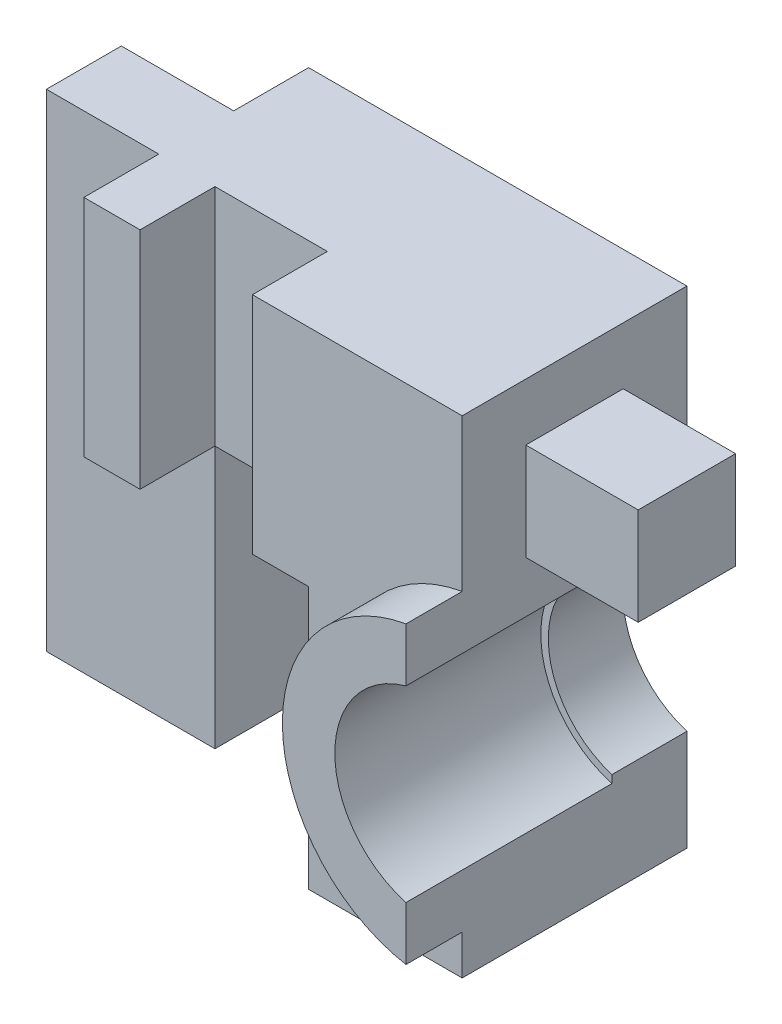
ISO-10303-21;
HEADER;
FILE_DESCRIPTION(('STEP AP214'),'2;1');
FILE_NAME('part.step','',(''),(''),'','','');
FILE_SCHEMA(('AUTOMOTIVE_DESIGN { 1 0 10303 214 1 1 1 1 }'));
ENDSEC;
DATA;
#1=APPLICATION_CONTEXT('core data for automotive mechanical design processes');
#2=APPLICATION_PROTOCOL_DEFINITION('international standard','automotive_design',2000,#1);
#3=PRODUCT_CONTEXT('',#1,'mechanical');
#4=PRODUCT('Part','Part','',(#3));
#5=PRODUCT_RELATED_PRODUCT_CATEGORY('part','',(#4));
#6=PRODUCT_DEFINITION_FORMATION('','',#4);
#7=PRODUCT_DEFINITION_CONTEXT('part definition',#1,'design');
#8=PRODUCT_DEFINITION('design','',#6,#7);
#9=PRODUCT_DEFINITION_SHAPE('','',#8);
#10=(LENGTH_UNIT() NAMED_UNIT(*) SI_UNIT(.MILLI.,.METRE.));
#11=(NAMED_UNIT(*) PLANE_ANGLE_UNIT() SI_UNIT($,.RADIAN.));
#12=(NAMED_UNIT(*) SI_UNIT($,.STERADIAN.) SOLID_ANGLE_UNIT());
#13=UNCERTAINTY_MEASURE_WITH_UNIT(LENGTH_MEASURE(1.E-05),#10,'distance_accuracy_value','');
#14=(GEOMETRIC_REPRESENTATION_CONTEXT(3) GLOBAL_UNCERTAINTY_ASSIGNED_CONTEXT((#13)) GLOBAL_UNIT_ASSIGNED_CONTEXT((#10,
#11,#12)) REPRESENTATION_CONTEXT('',''));
#15=CARTESIAN_POINT('',(0.,0.,0.));
#16=DIRECTION('',(0.,0.,1.));
#17=DIRECTION('',(1.,0.,0.));
#18=AXIS2_PLACEMENT_3D('',#15,#16,#17);
#19=CARTESIAN_POINT('',(-9.2,-5.,4.3));
#20=DIRECTION('',(0.,0.,-1.));
#21=DIRECTION('',(-1.,0.,0.));
#22=AXIS2_PLACEMENT_3D('',#19,#20,#21);
#23=PLANE('',#22);
#24=DIRECTION('',(-1.,0.,0.));
#25=VECTOR('',#24,1.);
#26=CARTESIAN_POINT('',(-9.2,3.87366945943055,4.3));
#27=LINE('',#26,#25);
#28=CARTESIAN_POINT('',(-9.2,3.87366945943055,4.3));
#29=VERTEX_POINT('',#28);
#30=CARTESIAN_POINT('',(-12.2,3.87366945943055,4.3));
#31=VERTEX_POINT('',#30);
#32=EDGE_CURVE('E61',#29,#31,#27,.T.);
#33=ORIENTED_EDGE('',*,*,#32,.F.);
#34=DIRECTION('',(0.,-1.,0.));
#35=VECTOR('',#34,1.);
#36=CARTESIAN_POINT('',(-9.2,6.47366945943055,4.3));
#37=LINE('',#36,#35);
#38=CARTESIAN_POINT('',(-9.2,6.47366945943055,4.3));
#39=VERTEX_POINT('',#38);
#40=EDGE_CURVE('E227',#39,#29,#37,.T.);
#41=ORIENTED_EDGE('',*,*,#40,.F.);
#42=DIRECTION('',(-1.,0.,0.));
#43=VECTOR('',#42,1.);
#44=CARTESIAN_POINT('',(-9.2,6.47366945943055,4.3));
#45=LINE('',#44,#43);
#46=CARTESIAN_POINT('',(-12.2,6.47366945943055,4.3));
#47=VERTEX_POINT('',#46);
#48=EDGE_CURVE('E264',#39,#47,#45,.T.);
#49=ORIENTED_EDGE('',*,*,#48,.T.);
#50=DIRECTION('',(0.,-1.,0.));
#51=VECTOR('',#50,1.);
#52=CARTESIAN_POINT('',(-12.2,-5.,4.3));
#53=LINE('',#52,#51);
#54=EDGE_CURVE('E229',#47,#31,#53,.T.);
#55=ORIENTED_EDGE('',*,*,#54,.T.);
#56=EDGE_LOOP('',(#33,#41,#49,#55));
#57=FACE_BOUND('',#56,.T.);
#58=ADVANCED_FACE('F43',(#57),#23,.F.);
#59=CARTESIAN_POINT('',(-9.2,3.87366945943055,-9.5));
#60=DIRECTION('',(0.,-1.,0.));
#61=DIRECTION('',(0.,0.,-1.));
#62=AXIS2_PLACEMENT_3D('',#59,#60,#61);
#63=PLANE('',#62);
#64=DIRECTION('',(-1.,0.,0.));
#65=VECTOR('',#64,1.);
#66=CARTESIAN_POINT('',(-9.2,3.87366945943055,1.7));
#67=LINE('',#66,#65);
#68=CARTESIAN_POINT('',(-9.2,3.87366945943055,1.7));
#69=VERTEX_POINT('',#68);
#70=CARTESIAN_POINT('',(-12.2,3.87366945943055,1.7));
#71=VERTEX_POINT('',#70);
#72=EDGE_CURVE('E69',#69,#71,#67,.T.);
#73=ORIENTED_EDGE('',*,*,#72,.F.);
#74=DIRECTION('',(0.,0.,-1.));
#75=VECTOR('',#74,1.);
#76=CARTESIAN_POINT('',(-9.2,3.87366945943055,4.3));
#77=LINE('',#76,#75);
#78=EDGE_CURVE('E234',#29,#69,#77,.T.);
#79=ORIENTED_EDGE('',*,*,#78,.F.);
#80=ORIENTED_EDGE('',*,*,#32,.T.);
#81=DIRECTION('',(0.,0.,1.));
#82=VECTOR('',#81,1.);
#83=CARTESIAN_POINT('',(-12.2,3.87366945943055,-9.5));
#84=LINE('',#83,#82);
#85=EDGE_CURVE('E254',#71,#31,#84,.T.);
#86=ORIENTED_EDGE('',*,*,#85,.F.);
#87=EDGE_LOOP('',(#73,#79,#80,#86));
#88=FACE_BOUND('',#87,.T.);
#89=ADVANCED_FACE('F235',(#88),#63,.T.);
#90=CARTESIAN_POINT('',(-9.2,-5.,1.7));
#91=DIRECTION('',(0.,0.,-1.));
#92=DIRECTION('',(-1.,0.,0.));
#93=AXIS2_PLACEMENT_3D('',#90,#91,#92);
#94=PLANE('',#93);
#95=DIRECTION('',(-1.,0.,0.));
#96=VECTOR('',#95,1.);
#97=CARTESIAN_POINT('',(-9.2,6.47366945943055,1.7));
#98=LINE('',#97,#96);
#99=CARTESIAN_POINT('',(-9.2,6.47366945943055,1.7));
#100=VERTEX_POINT('',#99);
#101=CARTESIAN_POINT('',(-12.2,6.47366945943055,1.7));
#102=VERTEX_POINT('',#101);
#103=EDGE_CURVE('E267',#100,#102,#98,.T.);
#104=ORIENTED_EDGE('',*,*,#103,.F.);
#105=DIRECTION('',(0.,1.,0.));
#106=VECTOR('',#105,1.);
#107=CARTESIAN_POINT('',(-9.2,6.47366945943055,1.7));
#108=LINE('',#107,#106);
#109=EDGE_CURVE('E239',#69,#100,#108,.T.);
#110=ORIENTED_EDGE('',*,*,#109,.F.);
#111=ORIENTED_EDGE('',*,*,#72,.T.);
#112=DIRECTION('',(0.,-1.,0.));
#113=VECTOR('',#112,1.);
#114=CARTESIAN_POINT('',(-12.2,-5.,1.7));
#115=LINE('',#114,#113);
#116=EDGE_CURVE('E257',#102,#71,#115,.T.);
#117=ORIENTED_EDGE('',*,*,#116,.F.);
#118=EDGE_LOOP('',(#104,#110,#111,#117));
#119=FACE_BOUND('',#118,.T.);
#120=ADVANCED_FACE('F622',(#119),#94,.T.);
#121=CARTESIAN_POINT('',(-9.2,6.47366945943055,-9.5));
#122=DIRECTION('',(0.,-1.,0.));
#123=DIRECTION('',(0.,0.,-1.));
#124=AXIS2_PLACEMENT_3D('',#121,#122,#123);
#125=PLANE('',#124);
#126=ORIENTED_EDGE('',*,*,#48,.F.);
#127=DIRECTION('',(0.,0.,1.));
#128=VECTOR('',#127,1.);
#129=CARTESIAN_POINT('',(-9.2,6.47366945943055,4.3));
#130=LINE('',#129,#128);
#131=EDGE_CURVE('E244',#100,#39,#130,.T.);
#132=ORIENTED_EDGE('',*,*,#131,.F.);
#133=ORIENTED_EDGE('',*,*,#103,.T.);
#134=DIRECTION('',(0.,0.,1.));
#135=VECTOR('',#134,1.);
#136=CARTESIAN_POINT('',(-12.2,6.47366945943055,-9.5));
#137=LINE('',#136,#135);
#138=EDGE_CURVE('E260',#102,#47,#137,.T.);
#139=ORIENTED_EDGE('',*,*,#138,.T.);
#140=EDGE_LOOP('',(#126,#132,#133,#139));
#141=FACE_BOUND('',#140,.T.);
#142=ADVANCED_FACE('F784',(#141),#125,.F.);
#143=CARTESIAN_POINT('',(-12.2,-5.,-9.5));
#144=DIRECTION('',(-1.,0.,0.));
#145=DIRECTION('',(0.,0.,1.));
#146=AXIS2_PLACEMENT_3D('',#143,#144,#145);
#147=PLANE('',#146);
#148=DIRECTION('',(0.,-1.,0.));
#149=VECTOR('',#148,1.);
#150=CARTESIAN_POINT('',(-12.2,0.,6.));
#151=LINE('',#150,#149);
#152=CARTESIAN_POINT('',(-12.2,8.,6.));
#153=VERTEX_POINT('',#152);
#154=CARTESIAN_POINT('',(-12.2,3.93827373350304,6.));
#155=VERTEX_POINT('',#154);
#156=EDGE_CURVE('E450',#153,#155,#151,.T.);
#157=ORIENTED_EDGE('',*,*,#156,.T.);
#158=DIRECTION('',(0.,0.,-1.));
#159=VECTOR('',#158,1.);
#160=CARTESIAN_POINT('',(-12.2,3.93827373350304,7.5));
#161=LINE('',#160,#159);
#162=CARTESIAN_POINT('',(-12.2,3.93827373350304,7.5));
#163=VERTEX_POINT('',#162);
#164=EDGE_CURVE('E440',#163,#155,#161,.T.);
#165=ORIENTED_EDGE('',*,*,#164,.F.);
#166=DIRECTION('',(0.,-1.,0.));
#167=VECTOR('',#166,1.);
#168=CARTESIAN_POINT('',(-12.2,0.,7.5));
#169=LINE('',#168,#167);
#170=CARTESIAN_POINT('',(-12.2,2.50399680510978,7.5));
#171=VERTEX_POINT('',#170);
#172=EDGE_CURVE('E446',#163,#171,#169,.T.);
#173=ORIENTED_EDGE('',*,*,#172,.T.);
#174=DIRECTION('',(0.,0.,-1.));
#175=VECTOR('',#174,1.);
#176=CARTESIAN_POINT('',(-12.2,2.50399680510978,6.));
#177=LINE('',#176,#175);
#178=CARTESIAN_POINT('',(-12.2,2.50399680510978,2.));
#179=VERTEX_POINT('',#178);
#180=EDGE_CURVE('E53',#171,#179,#177,.T.);
#181=ORIENTED_EDGE('',*,*,#180,.T.);
#182=DIRECTION('',(0.,1.,0.));
#183=VECTOR('',#182,1.);
#184=CARTESIAN_POINT('',(-12.2,0.,2.));
#185=LINE('',#184,#183);
#186=CARTESIAN_POINT('',(-12.2,2.2956480566498,2.));
#187=VERTEX_POINT('',#186);
#188=EDGE_CURVE('E468',#187,#179,#185,.T.);
#189=ORIENTED_EDGE('',*,*,#188,.F.);
#190=DIRECTION('',(0.,0.,-1.));
#191=VECTOR('',#190,1.);
#192=CARTESIAN_POINT('',(-12.2,2.2956480566498,2.));
#193=LINE('',#192,#191);
#194=CARTESIAN_POINT('',(-12.2,2.2956480566498,0.));
#195=VERTEX_POINT('',#194);
#196=EDGE_CURVE('E272',#195,#187,#193,.F.);
#197=ORIENTED_EDGE('',*,*,#196,.F.);
#198=DIRECTION('',(0.,-1.,0.));
#199=VECTOR('',#198,1.);
#200=CARTESIAN_POINT('',(-12.2,0.,0.));
#201=LINE('',#200,#199);
#202=CARTESIAN_POINT('',(-12.2,8.,0.));
#203=VERTEX_POINT('',#202);
#204=EDGE_CURVE('E464',#203,#195,#201,.T.);
#205=ORIENTED_EDGE('',*,*,#204,.F.);
#206=DIRECTION('',(0.,0.,1.));
#207=VECTOR('',#206,1.);
#208=CARTESIAN_POINT('',(-12.2,8.,-9.5));
#209=LINE('',#208,#207);
#210=EDGE_CURVE('E11',#203,#153,#209,.T.);
#211=ORIENTED_EDGE('',*,*,#210,.T.);
#212=EDGE_LOOP('',(#157,#165,#173,#181,#189,#197,#205,#211));
#213=FACE_BOUND('',#212,.T.);
#214=ORIENTED_EDGE('',*,*,#54,.F.);
#215=ORIENTED_EDGE('',*,*,#138,.F.);
#216=ORIENTED_EDGE('',*,*,#116,.T.);
#217=ORIENTED_EDGE('',*,*,#85,.T.);
#218=EDGE_LOOP('',(#214,#215,#216,#217));
#219=FACE_BOUND('',#218,.T.);
#220=ADVANCED_FACE('F543',(#213,#219),#147,.F.);
#221=CARTESIAN_POINT('',(0.,0.,6.));
#222=DIRECTION('',(0.,0.,1.));
#223=DIRECTION('',(1.,0.,0.));
#224=AXIS2_PLACEMENT_3D('',#221,#222,#223);
#225=PLANE('',#224);
#226=DIRECTION('',(0.,-1.,0.));
#227=VECTOR('',#226,1.);
#228=CARTESIAN_POINT('',(-20.8,9.,6.));
#229=LINE('',#228,#227);
#230=CARTESIAN_POINT('',(-20.8,8.,6.));
#231=VERTEX_POINT('',#230);
#232=CARTESIAN_POINT('',(-20.8,2.,6.));
#233=VERTEX_POINT('',#232);
#234=EDGE_CURVE('E409',#231,#233,#229,.T.);
#235=ORIENTED_EDGE('',*,*,#234,.F.);
#236=DIRECTION('',(1.,0.,0.));
#237=VECTOR('',#236,1.);
#238=CARTESIAN_POINT('',(0.,8.,6.));
#239=LINE('',#238,#237);
#240=CARTESIAN_POINT('',(-22.3,8.,6.));
#241=VERTEX_POINT('',#240);
#242=EDGE_CURVE('E286',#241,#231,#239,.T.);
#243=ORIENTED_EDGE('',*,*,#242,.F.);
#244=DIRECTION('',(0.,-1.,0.));
#245=VECTOR('',#244,1.);
#246=CARTESIAN_POINT('',(-22.3,8.,6.));
#247=LINE('',#246,#245);
#248=CARTESIAN_POINT('',(-22.3,2.00000000000001,6.));
#249=VERTEX_POINT('',#248);
#250=EDGE_CURVE('E231',#241,#249,#247,.T.);
#251=ORIENTED_EDGE('',*,*,#250,.T.);
#252=DIRECTION('',(-1.,0.,0.));
#253=VECTOR('',#252,1.);
#254=CARTESIAN_POINT('',(-22.3,2.00000000000001,6.));
#255=LINE('',#254,#253);
#256=EDGE_CURVE('E381',#233,#249,#255,.T.);
#257=ORIENTED_EDGE('',*,*,#256,.F.);
#258=EDGE_LOOP('',(#235,#243,#251,#257));
#259=FACE_BOUND('',#258,.T.);
#260=ADVANCED_FACE('F570',(#259),#225,.T.);
#261=CARTESIAN_POINT('',(0.,2.,0.));
#262=DIRECTION('',(0.,1.,0.));
#263=DIRECTION('',(-1.,0.,0.));
#264=AXIS2_PLACEMENT_3D('',#261,#262,#263);
#265=PLANE('',#264);
#266=DIRECTION('',(1.,0.,0.));
#267=VECTOR('',#266,1.);
#268=CARTESIAN_POINT('',(-20.8,2.00000000000001,4.));
#269=LINE('',#268,#267);
#270=CARTESIAN_POINT('',(-22.3,2.00000000000001,4.));
#271=VERTEX_POINT('',#270);
#272=CARTESIAN_POINT('',(-20.8,2.00000000000001,4.));
#273=VERTEX_POINT('',#272);
#274=EDGE_CURVE('E302',#271,#273,#269,.T.);
#275=ORIENTED_EDGE('',*,*,#274,.T.);
#276=DIRECTION('',(0.,0.,-1.));
#277=VECTOR('',#276,1.);
#278=CARTESIAN_POINT('',(-20.8,2.,4.));
#279=LINE('',#278,#277);
#280=EDGE_CURVE('E414',#233,#273,#279,.T.);
#281=ORIENTED_EDGE('',*,*,#280,.F.);
#282=ORIENTED_EDGE('',*,*,#256,.T.);
#283=DIRECTION('',(0.,0.,-1.));
#284=VECTOR('',#283,1.);
#285=CARTESIAN_POINT('',(-22.3,2.00000000000001,4.));
#286=LINE('',#285,#284);
#287=EDGE_CURVE('E380',#249,#271,#286,.T.);
#288=ORIENTED_EDGE('',*,*,#287,.T.);
#289=EDGE_LOOP('',(#275,#281,#282,#288));
#290=FACE_BOUND('',#289,.T.);
#291=ADVANCED_FACE('F562',(#290),#265,.F.);
#292=CARTESIAN_POINT('',(-16.3,2.,6.));
#293=VERTEX_POINT('',#292);
#294=CARTESIAN_POINT('',(-17.8,2.,6.));
#295=VERTEX_POINT('',#294);
#296=EDGE_CURVE('E375',#293,#295,#255,.T.);
#297=ORIENTED_EDGE('',*,*,#296,.T.);
#298=DIRECTION('',(0.,0.,1.));
#299=VECTOR('',#298,1.);
#300=CARTESIAN_POINT('',(-17.8,2.,4.));
#301=LINE('',#300,#299);
#302=CARTESIAN_POINT('',(-17.8,2.,4.));
#303=VERTEX_POINT('',#302);
#304=EDGE_CURVE('E419',#303,#295,#301,.T.);
#305=ORIENTED_EDGE('',*,*,#304,.F.);
#306=DIRECTION('',(1.,0.,0.));
#307=VECTOR('',#306,1.);
#308=CARTESIAN_POINT('',(-16.3,2.,4.));
#309=LINE('',#308,#307);
#310=CARTESIAN_POINT('',(-16.3,2.,4.));
#311=VERTEX_POINT('',#310);
#312=EDGE_CURVE('E379',#303,#311,#309,.T.);
#313=ORIENTED_EDGE('',*,*,#312,.T.);
#314=DIRECTION('',(0.,0.,1.));
#315=VECTOR('',#314,1.);
#316=CARTESIAN_POINT('',(-16.3,2.,6.));
#317=LINE('',#316,#315);
#318=EDGE_CURVE('E382',#311,#293,#317,.T.);
#319=ORIENTED_EDGE('',*,*,#318,.T.);
#320=EDGE_LOOP('',(#297,#305,#313,#319));
#321=FACE_BOUND('',#320,.T.);
#322=ADVANCED_FACE('F598',(#321),#265,.F.);
#323=CARTESIAN_POINT('',(0.,-5.,6.));
#324=DIRECTION('',(0.,1.,0.));
#325=DIRECTION('',(-1.,0.,0.));
#326=AXIS2_PLACEMENT_3D('',#323,#324,#325);
#327=PLANE('',#326);
#328=DIRECTION('',(1.,0.,0.));
#329=VECTOR('',#328,1.);
#330=CARTESIAN_POINT('',(0.,-5.,0.));
#331=LINE('',#330,#329);
#332=CARTESIAN_POINT('',(-17.8,-4.99999999999999,0.));
#333=VERTEX_POINT('',#332);
#334=CARTESIAN_POINT('',(-12.2,-5.,0.));
#335=VERTEX_POINT('',#334);
#336=EDGE_CURVE('E386',#333,#335,#331,.T.);
#337=ORIENTED_EDGE('',*,*,#336,.T.);
#338=DIRECTION('',(0.,0.,1.));
#339=VECTOR('',#338,1.);
#340=CARTESIAN_POINT('',(-12.2,-5.,-9.5));
#341=LINE('',#340,#339);
#342=CARTESIAN_POINT('',(-12.2,-5.,6.));
#343=VERTEX_POINT('',#342);
#344=EDGE_CURVE('E470',#335,#343,#341,.T.);
#345=ORIENTED_EDGE('',*,*,#344,.T.);
#346=DIRECTION('',(1.,0.,0.));
#347=VECTOR('',#346,1.);
#348=CARTESIAN_POINT('',(0.,-5.,6.));
#349=LINE('',#348,#347);
#350=CARTESIAN_POINT('',(-16.3,-5.,6.));
#351=VERTEX_POINT('',#350);
#352=EDGE_CURVE('E287',#351,#343,#349,.T.);
#353=ORIENTED_EDGE('',*,*,#352,.F.);
#354=DIRECTION('',(0.,0.,1.));
#355=VECTOR('',#354,1.);
#356=CARTESIAN_POINT('',(-16.3,-5.,6.));
#357=LINE('',#356,#355);
#358=CARTESIAN_POINT('',(-16.3,-5.,4.));
#359=VERTEX_POINT('',#358);
#360=EDGE_CURVE('E281',#359,#351,#357,.T.);
#361=ORIENTED_EDGE('',*,*,#360,.F.);
#362=DIRECTION('',(1.,0.,0.));
#363=VECTOR('',#362,1.);
#364=CARTESIAN_POINT('',(-16.3,-5.,4.));
#365=LINE('',#364,#363);
#366=CARTESIAN_POINT('',(-17.8,-4.99999999999999,4.));
#367=VERTEX_POINT('',#366);
#368=EDGE_CURVE('E356',#367,#359,#365,.T.);
#369=ORIENTED_EDGE('',*,*,#368,.F.);
#370=DIRECTION('',(0.,0.,1.));
#371=VECTOR('',#370,1.);
#372=CARTESIAN_POINT('',(-17.8,-4.99999999999999,4.));
#373=LINE('',#372,#371);
#374=EDGE_CURVE('E352',#333,#367,#373,.T.);
#375=ORIENTED_EDGE('',*,*,#374,.F.);
#376=EDGE_LOOP('',(#337,#345,#353,#361,#369,#375));
#377=FACE_BOUND('',#376,.T.);
#378=ADVANCED_FACE('F522',(#377),#327,.F.);
#379=CARTESIAN_POINT('',(-11.5,0.,6.));
#380=DIRECTION('',(0.,0.,-1.));
#381=DIRECTION('',(-1.,0.,0.));
#382=AXIS2_PLACEMENT_3D('',#379,#380,#381);
#383=CYLINDRICAL_SURFACE('',#382,2.6);
#384=ORIENTED_EDGE('',*,*,#180,.F.);
#385=CARTESIAN_POINT('',(-11.5,0.,7.5));
#386=DIRECTION('',(0.,0.,1.));
#387=DIRECTION('',(1.,0.,0.));
#388=AXIS2_PLACEMENT_3D('',#385,#386,#387);
#389=CIRCLE('',#388,2.6);
#390=CARTESIAN_POINT('',(-12.2,-2.50399680510978,7.5));
#391=VERTEX_POINT('',#390);
#392=EDGE_CURVE('E474',#171,#391,#389,.T.);
#393=ORIENTED_EDGE('',*,*,#392,.T.);
#394=DIRECTION('',(0.,0.,-1.));
#395=VECTOR('',#394,1.);
#396=CARTESIAN_POINT('',(-12.2,-2.50399680510978,6.));
#397=LINE('',#396,#395);
#398=CARTESIAN_POINT('',(-12.2,-2.50399680510978,2.));
#399=VERTEX_POINT('',#398);
#400=EDGE_CURVE('E449',#399,#391,#397,.F.);
#401=ORIENTED_EDGE('',*,*,#400,.F.);
#402=CARTESIAN_POINT('',(-11.5,0.,2.));
#403=DIRECTION('',(0.,0.,-1.));
#404=DIRECTION('',(-1.,0.,0.));
#405=AXIS2_PLACEMENT_3D('',#402,#403,#404);
#406=CIRCLE('',#405,2.6);
#407=EDGE_CURVE('E429',#399,#179,#406,.T.);
#408=ORIENTED_EDGE('',*,*,#407,.T.);
#409=EDGE_LOOP('',(#384,#393,#401,#408));
#410=FACE_BOUND('',#409,.T.);
#411=ADVANCED_FACE('F541',(#410),#383,.F.);
#412=ORIENTED_EDGE('',*,*,#156,.F.);
#413=CARTESIAN_POINT('',(-17.8,8.,6.));
#414=VERTEX_POINT('',#413);
#415=EDGE_CURVE('E478',#414,#153,#239,.T.);
#416=ORIENTED_EDGE('',*,*,#415,.F.);
#417=DIRECTION('',(0.,-1.,0.));
#418=VECTOR('',#417,1.);
#419=CARTESIAN_POINT('',(-17.8,9.,6.));
#420=LINE('',#419,#418);
#421=EDGE_CURVE('E364',#414,#295,#420,.T.);
#422=ORIENTED_EDGE('',*,*,#421,.T.);
#423=ORIENTED_EDGE('',*,*,#296,.F.);
#424=DIRECTION('',(0.,-1.,0.));
#425=VECTOR('',#424,1.);
#426=CARTESIAN_POINT('',(-16.3,2.,6.));
#427=LINE('',#426,#425);
#428=EDGE_CURVE('E360',#293,#351,#427,.T.);
#429=ORIENTED_EDGE('',*,*,#428,.T.);
#430=ORIENTED_EDGE('',*,*,#352,.T.);
#431=CARTESIAN_POINT('',(-12.2,-3.93827373350304,6.));
#432=VERTEX_POINT('',#431);
#433=EDGE_CURVE('E437',#432,#343,#151,.T.);
#434=ORIENTED_EDGE('',*,*,#433,.F.);
#435=CARTESIAN_POINT('',(-11.5,0.,6.));
#436=DIRECTION('',(0.,0.,1.));
#437=DIRECTION('',(1.,0.,0.));
#438=AXIS2_PLACEMENT_3D('',#435,#436,#437);
#439=CIRCLE('',#438,4.);
#440=EDGE_CURVE('E47',#155,#432,#439,.T.);
#441=ORIENTED_EDGE('',*,*,#440,.F.);
#442=EDGE_LOOP('',(#412,#416,#422,#423,#429,#430,#434,#441));
#443=FACE_BOUND('',#442,.T.);
#444=ADVANCED_FACE('F516',(#443),#225,.T.);
#445=CARTESIAN_POINT('',(-22.3,8.,6.));
#446=DIRECTION('',(1.,0.,0.));
#447=DIRECTION('',(0.,0.,-1.));
#448=AXIS2_PLACEMENT_3D('',#445,#446,#447);
#449=PLANE('',#448);
#450=DIRECTION('',(0.,1.,0.));
#451=VECTOR('',#450,1.);
#452=CARTESIAN_POINT('',(-22.3,-8.60555127546399,4.));
#453=LINE('',#452,#451);
#454=CARTESIAN_POINT('',(-22.3,8.,4.));
#455=VERTEX_POINT('',#454);
#456=EDGE_CURVE('E312',#271,#455,#453,.T.);
#457=ORIENTED_EDGE('',*,*,#456,.F.);
#458=ORIENTED_EDGE('',*,*,#287,.F.);
#459=ORIENTED_EDGE('',*,*,#250,.F.);
#460=DIRECTION('',(0.,0.,-1.));
#461=VECTOR('',#460,1.);
#462=CARTESIAN_POINT('',(-22.3,8.,6.));
#463=LINE('',#462,#461);
#464=EDGE_CURVE('E282',#241,#455,#463,.T.);
#465=ORIENTED_EDGE('',*,*,#464,.T.);
#466=EDGE_LOOP('',(#457,#458,#459,#465));
#467=FACE_BOUND('',#466,.T.);
#468=ADVANCED_FACE('F569',(#467),#449,.F.);
#469=CARTESIAN_POINT('',(0.,8.,6.));
#470=DIRECTION('',(0.,1.,0.));
#471=DIRECTION('',(0.,0.,1.));
#472=AXIS2_PLACEMENT_3D('',#469,#470,#471);
#473=PLANE('',#472);
#474=ORIENTED_EDGE('',*,*,#210,.F.);
#475=DIRECTION('',(1.,0.,0.));
#476=VECTOR('',#475,1.);
#477=CARTESIAN_POINT('',(0.,8.,0.));
#478=LINE('',#477,#476);
#479=CARTESIAN_POINT('',(-22.3,8.,0.));
#480=VERTEX_POINT('',#479);
#481=EDGE_CURVE('E292',#480,#203,#478,.T.);
#482=ORIENTED_EDGE('',*,*,#481,.F.);
#483=CARTESIAN_POINT('',(-22.3,8.,2.));
#484=VERTEX_POINT('',#483);
#485=EDGE_CURVE('E288',#484,#480,#463,.T.);
#486=ORIENTED_EDGE('',*,*,#485,.F.);
#487=DIRECTION('',(1.,0.,0.));
#488=VECTOR('',#487,1.);
#489=CARTESIAN_POINT('',(0.,8.,1.99999999999999));
#490=LINE('',#489,#488);
#491=CARTESIAN_POINT('',(-25.3,8.,2.));
#492=VERTEX_POINT('',#491);
#493=EDGE_CURVE('E323',#492,#484,#490,.T.);
#494=ORIENTED_EDGE('',*,*,#493,.F.);
#495=DIRECTION('',(0.,0.,-1.));
#496=VECTOR('',#495,1.);
#497=CARTESIAN_POINT('',(-25.3,8.,6.));
#498=LINE('',#497,#496);
#499=CARTESIAN_POINT('',(-25.3,8.,4.));
#500=VERTEX_POINT('',#499);
#501=EDGE_CURVE('E319',#500,#492,#498,.T.);
#502=ORIENTED_EDGE('',*,*,#501,.F.);
#503=DIRECTION('',(-1.,0.,0.));
#504=VECTOR('',#503,1.);
#505=CARTESIAN_POINT('',(0.,8.,3.99999999999999));
#506=LINE('',#505,#504);
#507=EDGE_CURVE('E315',#455,#500,#506,.T.);
#508=ORIENTED_EDGE('',*,*,#507,.F.);
#509=ORIENTED_EDGE('',*,*,#464,.F.);
#510=ORIENTED_EDGE('',*,*,#242,.T.);
#511=DIRECTION('',(0.,0.,1.));
#512=VECTOR('',#511,1.);
#513=CARTESIAN_POINT('',(-20.8,8.,6.));
#514=LINE('',#513,#512);
#515=CARTESIAN_POINT('',(-20.8,8.,4.));
#516=VERTEX_POINT('',#515);
#517=EDGE_CURVE('E398',#516,#231,#514,.T.);
#518=ORIENTED_EDGE('',*,*,#517,.F.);
#519=DIRECTION('',(-1.,0.,0.));
#520=VECTOR('',#519,1.);
#521=CARTESIAN_POINT('',(0.,8.,4.));
#522=LINE('',#521,#520);
#523=CARTESIAN_POINT('',(-17.8,8.,4.));
#524=VERTEX_POINT('',#523);
#525=EDGE_CURVE('E415',#524,#516,#522,.T.);
#526=ORIENTED_EDGE('',*,*,#525,.F.);
#527=DIRECTION('',(0.,0.,-1.));
#528=VECTOR('',#527,1.);
#529=CARTESIAN_POINT('',(-17.8,8.,6.));
#530=LINE('',#529,#528);
#531=EDGE_CURVE('E410',#414,#524,#530,.T.);
#532=ORIENTED_EDGE('',*,*,#531,.F.);
#533=ORIENTED_EDGE('',*,*,#415,.T.);
#534=EDGE_LOOP('',(#474,#482,#486,#494,#502,#508,#509,#510,#518,#526,#532,#533));
#535=FACE_BOUND('',#534,.T.);
#536=ADVANCED_FACE('F552',(#535),#473,.T.);
#537=CARTESIAN_POINT('',(-22.3,-5.,0.));
#538=VERTEX_POINT('',#537);
#539=CARTESIAN_POINT('',(-20.8,-4.99999999999999,0.));
#540=VERTEX_POINT('',#539);
#541=EDGE_CURVE('E293',#538,#540,#331,.T.);
#542=ORIENTED_EDGE('',*,*,#541,.T.);
#543=DIRECTION('',(0.,0.,-1.));
#544=VECTOR('',#543,1.);
#545=CARTESIAN_POINT('',(-20.8,-4.99999999999999,0.));
#546=LINE('',#545,#544);
#547=CARTESIAN_POINT('',(-20.8,-4.99999999999999,4.));
#548=VERTEX_POINT('',#547);
#549=EDGE_CURVE('E344',#548,#540,#546,.T.);
#550=ORIENTED_EDGE('',*,*,#549,.F.);
#551=DIRECTION('',(1.,0.,0.));
#552=VECTOR('',#551,1.);
#553=CARTESIAN_POINT('',(0.,-5.,3.99999999999999));
#554=LINE('',#553,#552);
#555=CARTESIAN_POINT('',(-25.3,-4.99999999999999,4.));
#556=VERTEX_POINT('',#555);
#557=EDGE_CURVE('E316',#556,#548,#554,.T.);
#558=ORIENTED_EDGE('',*,*,#557,.F.);
#559=DIRECTION('',(0.,0.,1.));
#560=VECTOR('',#559,1.);
#561=CARTESIAN_POINT('',(-25.3,-4.99999999999999,6.));
#562=LINE('',#561,#560);
#563=CARTESIAN_POINT('',(-25.3,-4.99999999999999,2.));
#564=VERTEX_POINT('',#563);
#565=EDGE_CURVE('E298',#564,#556,#562,.T.);
#566=ORIENTED_EDGE('',*,*,#565,.F.);
#567=DIRECTION('',(-1.,0.,0.));
#568=VECTOR('',#567,1.);
#569=CARTESIAN_POINT('',(0.,-5.,1.99999999999999));
#570=LINE('',#569,#568);
#571=CARTESIAN_POINT('',(-22.3,-4.99999999999999,2.));
#572=VERTEX_POINT('',#571);
#573=EDGE_CURVE('E324',#572,#564,#570,.T.);
#574=ORIENTED_EDGE('',*,*,#573,.F.);
#575=DIRECTION('',(0.,0.,-1.));
#576=VECTOR('',#575,1.);
#577=CARTESIAN_POINT('',(-22.3,-5.,6.));
#578=LINE('',#577,#576);
#579=EDGE_CURVE('E289',#572,#538,#578,.T.);
#580=ORIENTED_EDGE('',*,*,#579,.T.);
#581=EDGE_LOOP('',(#542,#550,#558,#566,#574,#580));
#582=FACE_BOUND('',#581,.T.);
#583=ADVANCED_FACE('F45',(#582),#327,.F.);
#584=CARTESIAN_POINT('',(0.,0.,0.));
#585=DIRECTION('',(0.,0.,1.));
#586=DIRECTION('',(1.,0.,0.));
#587=AXIS2_PLACEMENT_3D('',#584,#585,#586);
#588=PLANE('',#587);
#589=ORIENTED_EDGE('',*,*,#481,.T.);
#590=ORIENTED_EDGE('',*,*,#204,.T.);
#591=CARTESIAN_POINT('',(-11.5,0.,0.));
#592=DIRECTION('',(0.,0.,-1.));
#593=DIRECTION('',(-1.,0.,0.));
#594=AXIS2_PLACEMENT_3D('',#591,#592,#593);
#595=CIRCLE('',#594,2.4);
#596=CARTESIAN_POINT('',(-12.2,-2.2956480566498,0.));
#597=VERTEX_POINT('',#596);
#598=EDGE_CURVE('E277',#597,#195,#595,.T.);
#599=ORIENTED_EDGE('',*,*,#598,.F.);
#600=EDGE_CURVE('E348',#597,#335,#201,.T.);
#601=ORIENTED_EDGE('',*,*,#600,.T.);
#602=ORIENTED_EDGE('',*,*,#336,.F.);
#603=DIRECTION('',(0.,-1.,0.));
#604=VECTOR('',#603,1.);
#605=CARTESIAN_POINT('',(-17.8,2.00000000000001,0.));
#606=LINE('',#605,#604);
#607=CARTESIAN_POINT('',(-17.8,2.00000000000001,0.));
#608=VERTEX_POINT('',#607);
#609=EDGE_CURVE('E349',#608,#333,#606,.T.);
#610=ORIENTED_EDGE('',*,*,#609,.F.);
#611=DIRECTION('',(1.,0.,0.));
#612=VECTOR('',#611,1.);
#613=CARTESIAN_POINT('',(-17.8,2.00000000000001,0.));
#614=LINE('',#613,#612);
#615=CARTESIAN_POINT('',(-20.8,2.00000000000001,0.));
#616=VERTEX_POINT('',#615);
#617=EDGE_CURVE('E394',#616,#608,#614,.T.);
#618=ORIENTED_EDGE('',*,*,#617,.F.);
#619=DIRECTION('',(0.,-1.,0.));
#620=VECTOR('',#619,1.);
#621=CARTESIAN_POINT('',(-20.8,2.00000000000001,0.));
#622=LINE('',#621,#620);
#623=EDGE_CURVE('E311',#616,#540,#622,.T.);
#624=ORIENTED_EDGE('',*,*,#623,.T.);
#625=ORIENTED_EDGE('',*,*,#541,.F.);
#626=DIRECTION('',(0.,-1.,0.));
#627=VECTOR('',#626,1.);
#628=CARTESIAN_POINT('',(-22.3,8.,0.));
#629=LINE('',#628,#627);
#630=EDGE_CURVE('E294',#480,#538,#629,.T.);
#631=ORIENTED_EDGE('',*,*,#630,.F.);
#632=EDGE_LOOP('',(#589,#590,#599,#601,#602,#610,#618,#624,#625,#631));
#633=FACE_BOUND('',#632,.T.);
#634=ADVANCED_FACE('F528',(#633),#588,.F.);
#635=ORIENTED_EDGE('',*,*,#579,.F.);
#636=DIRECTION('',(0.,1.,0.));
#637=VECTOR('',#636,1.);
#638=CARTESIAN_POINT('',(-22.3,-8.60555127546399,2.));
#639=LINE('',#638,#637);
#640=EDGE_CURVE('E307',#572,#484,#639,.T.);
#641=ORIENTED_EDGE('',*,*,#640,.T.);
#642=ORIENTED_EDGE('',*,*,#485,.T.);
#643=ORIENTED_EDGE('',*,*,#630,.T.);
#644=EDGE_LOOP('',(#635,#641,#642,#643));
#645=FACE_BOUND('',#644,.T.);
#646=ADVANCED_FACE('F626',(#645),#449,.F.);
#647=CARTESIAN_POINT('',(-25.3,-8.60555127546399,6.));
#648=DIRECTION('',(1.,0.,0.));
#649=DIRECTION('',(0.,0.,-1.));
#650=AXIS2_PLACEMENT_3D('',#647,#648,#649);
#651=PLANE('',#650);
#652=DIRECTION('',(0.,1.,0.));
#653=VECTOR('',#652,1.);
#654=CARTESIAN_POINT('',(-25.3,-8.60555127546399,2.));
#655=LINE('',#654,#653);
#656=EDGE_CURVE('E320',#564,#492,#655,.T.);
#657=ORIENTED_EDGE('',*,*,#656,.F.);
#658=ORIENTED_EDGE('',*,*,#565,.T.);
#659=DIRECTION('',(0.,1.,0.));
#660=VECTOR('',#659,1.);
#661=CARTESIAN_POINT('',(-25.3,-8.60555127546399,4.));
#662=LINE('',#661,#660);
#663=EDGE_CURVE('E306',#556,#500,#662,.T.);
#664=ORIENTED_EDGE('',*,*,#663,.T.);
#665=ORIENTED_EDGE('',*,*,#501,.T.);
#666=EDGE_LOOP('',(#657,#658,#664,#665));
#667=FACE_BOUND('',#666,.T.);
#668=ADVANCED_FACE('F629',(#667),#651,.F.);
#669=CARTESIAN_POINT('',(0.,-8.60555127546399,3.99999999999999));
#670=DIRECTION('',(0.,0.,-1.));
#671=DIRECTION('',(-1.,0.,0.));
#672=AXIS2_PLACEMENT_3D('',#669,#670,#671);
#673=PLANE('',#672);
#674=ORIENTED_EDGE('',*,*,#663,.F.);
#675=ORIENTED_EDGE('',*,*,#557,.T.);
#676=DIRECTION('',(0.,-1.,0.));
#677=VECTOR('',#676,1.);
#678=CARTESIAN_POINT('',(-20.8,2.00000000000001,4.));
#679=LINE('',#678,#677);
#680=EDGE_CURVE('E339',#273,#548,#679,.T.);
#681=ORIENTED_EDGE('',*,*,#680,.F.);
#682=ORIENTED_EDGE('',*,*,#274,.F.);
#683=ORIENTED_EDGE('',*,*,#456,.T.);
#684=ORIENTED_EDGE('',*,*,#507,.T.);
#685=EDGE_LOOP('',(#674,#675,#681,#682,#683,#684));
#686=FACE_BOUND('',#685,.T.);
#687=ADVANCED_FACE('F578',(#686),#673,.F.);
#688=CARTESIAN_POINT('',(0.,-8.60555127546399,1.99999999999999));
#689=DIRECTION('',(0.,0.,1.));
#690=DIRECTION('',(1.,0.,0.));
#691=AXIS2_PLACEMENT_3D('',#688,#689,#690);
#692=PLANE('',#691);
#693=ORIENTED_EDGE('',*,*,#640,.F.);
#694=ORIENTED_EDGE('',*,*,#573,.T.);
#695=ORIENTED_EDGE('',*,*,#656,.T.);
#696=ORIENTED_EDGE('',*,*,#493,.T.);
#697=EDGE_LOOP('',(#693,#694,#695,#696));
#698=FACE_BOUND('',#697,.T.);
#699=ADVANCED_FACE('F631',(#698),#692,.F.);
#700=CARTESIAN_POINT('',(-11.5,0.,7.5));
#701=DIRECTION('',(0.,0.,1.));
#702=DIRECTION('',(1.,0.,0.));
#703=AXIS2_PLACEMENT_3D('',#700,#701,#702);
#704=PLANE('',#703);
#705=ORIENTED_EDGE('',*,*,#172,.F.);
#706=CARTESIAN_POINT('',(-11.5,0.,7.5));
#707=DIRECTION('',(0.,0.,1.));
#708=DIRECTION('',(1.,0.,0.));
#709=AXIS2_PLACEMENT_3D('',#706,#707,#708);
#710=CIRCLE('',#709,4.);
#711=CARTESIAN_POINT('',(-12.2,-3.93827373350304,7.5));
#712=VERTEX_POINT('',#711);
#713=EDGE_CURVE('E333',#163,#712,#710,.T.);
#714=ORIENTED_EDGE('',*,*,#713,.T.);
#715=EDGE_CURVE('E456',#391,#712,#169,.T.);
#716=ORIENTED_EDGE('',*,*,#715,.F.);
#717=ORIENTED_EDGE('',*,*,#392,.F.);
#718=EDGE_LOOP('',(#705,#714,#716,#717));
#719=FACE_BOUND('',#718,.T.);
#720=ADVANCED_FACE('F505',(#719),#704,.T.);
#721=CARTESIAN_POINT('',(-11.5,0.,7.5));
#722=DIRECTION('',(0.,0.,-1.));
#723=DIRECTION('',(-1.,0.,0.));
#724=AXIS2_PLACEMENT_3D('',#721,#722,#723);
#725=CYLINDRICAL_SURFACE('',#724,4.);
#726=ORIENTED_EDGE('',*,*,#713,.F.);
#727=ORIENTED_EDGE('',*,*,#164,.T.);
#728=ORIENTED_EDGE('',*,*,#440,.T.);
#729=DIRECTION('',(0.,0.,-1.));
#730=VECTOR('',#729,1.);
#731=CARTESIAN_POINT('',(-12.2,-3.93827373350304,7.5));
#732=LINE('',#731,#730);
#733=EDGE_CURVE('E451',#432,#712,#732,.F.);
#734=ORIENTED_EDGE('',*,*,#733,.T.);
#735=EDGE_LOOP('',(#726,#727,#728,#734));
#736=FACE_BOUND('',#735,.T.);
#737=ADVANCED_FACE('F508',(#736),#725,.T.);
#738=CARTESIAN_POINT('',(-11.5,0.,2.));
#739=DIRECTION('',(0.,0.,-1.));
#740=DIRECTION('',(-1.,0.,0.));
#741=AXIS2_PLACEMENT_3D('',#738,#739,#740);
#742=PLANE('',#741);
#743=ORIENTED_EDGE('',*,*,#407,.F.);
#744=CARTESIAN_POINT('',(-12.2,-2.2956480566498,2.));
#745=VERTEX_POINT('',#744);
#746=EDGE_CURVE('E455',#399,#745,#185,.T.);
#747=ORIENTED_EDGE('',*,*,#746,.T.);
#748=CARTESIAN_POINT('',(-11.5,0.,2.));
#749=DIRECTION('',(0.,0.,-1.));
#750=DIRECTION('',(-1.,0.,0.));
#751=AXIS2_PLACEMENT_3D('',#748,#749,#750);
#752=CIRCLE('',#751,2.4);
#753=EDGE_CURVE('E467',#745,#187,#752,.T.);
#754=ORIENTED_EDGE('',*,*,#753,.T.);
#755=ORIENTED_EDGE('',*,*,#188,.T.);
#756=EDGE_LOOP('',(#743,#747,#754,#755));
#757=FACE_BOUND('',#756,.T.);
#758=ADVANCED_FACE('F537',(#757),#742,.F.);
#759=CARTESIAN_POINT('',(-11.5,0.,2.));
#760=DIRECTION('',(0.,0.,-1.));
#761=DIRECTION('',(-1.,0.,0.));
#762=AXIS2_PLACEMENT_3D('',#759,#760,#761);
#763=CYLINDRICAL_SURFACE('',#762,2.4);
#764=ORIENTED_EDGE('',*,*,#598,.T.);
#765=ORIENTED_EDGE('',*,*,#196,.T.);
#766=ORIENTED_EDGE('',*,*,#753,.F.);
#767=DIRECTION('',(0.,0.,-1.));
#768=VECTOR('',#767,1.);
#769=CARTESIAN_POINT('',(-12.2,-2.2956480566498,2.));
#770=LINE('',#769,#768);
#771=EDGE_CURVE('E276',#745,#597,#770,.T.);
#772=ORIENTED_EDGE('',*,*,#771,.T.);
#773=EDGE_LOOP('',(#764,#765,#766,#772));
#774=FACE_BOUND('',#773,.T.);
#775=ADVANCED_FACE('F532',(#774),#763,.F.);
#776=CARTESIAN_POINT('',(-16.3,2.,6.));
#777=DIRECTION('',(1.,0.,0.));
#778=DIRECTION('',(0.,1.,0.));
#779=AXIS2_PLACEMENT_3D('',#776,#777,#778);
#780=PLANE('',#779);
#781=ORIENTED_EDGE('',*,*,#360,.T.);
#782=ORIENTED_EDGE('',*,*,#428,.F.);
#783=ORIENTED_EDGE('',*,*,#318,.F.);
#784=DIRECTION('',(0.,-1.,0.));
#785=VECTOR('',#784,1.);
#786=CARTESIAN_POINT('',(-16.3,2.,4.));
#787=LINE('',#786,#785);
#788=EDGE_CURVE('E357',#311,#359,#787,.T.);
#789=ORIENTED_EDGE('',*,*,#788,.T.);
#790=EDGE_LOOP('',(#781,#782,#783,#789));
#791=FACE_BOUND('',#790,.T.);
#792=ADVANCED_FACE('F646',(#791),#780,.F.);
#793=CARTESIAN_POINT('',(-16.3,2.,4.));
#794=DIRECTION('',(0.,0.,-1.));
#795=DIRECTION('',(-1.,0.,0.));
#796=AXIS2_PLACEMENT_3D('',#793,#794,#795);
#797=PLANE('',#796);
#798=ORIENTED_EDGE('',*,*,#368,.T.);
#799=ORIENTED_EDGE('',*,*,#788,.F.);
#800=ORIENTED_EDGE('',*,*,#312,.F.);
#801=DIRECTION('',(0.,-1.,0.));
#802=VECTOR('',#801,1.);
#803=CARTESIAN_POINT('',(-17.8,2.00000000000001,4.));
#804=LINE('',#803,#802);
#805=EDGE_CURVE('E353',#303,#367,#804,.T.);
#806=ORIENTED_EDGE('',*,*,#805,.T.);
#807=EDGE_LOOP('',(#798,#799,#800,#806));
#808=FACE_BOUND('',#807,.T.);
#809=ADVANCED_FACE('F593',(#808),#797,.F.);
#810=CARTESIAN_POINT('',(-17.8,2.00000000000001,4.));
#811=DIRECTION('',(1.,0.,0.));
#812=DIRECTION('',(0.,1.,0.));
#813=AXIS2_PLACEMENT_3D('',#810,#811,#812);
#814=PLANE('',#813);
#815=ORIENTED_EDGE('',*,*,#374,.T.);
#816=ORIENTED_EDGE('',*,*,#805,.F.);
#817=DIRECTION('',(0.,0.,1.));
#818=VECTOR('',#817,1.);
#819=CARTESIAN_POINT('',(-17.8,2.00000000000001,4.));
#820=LINE('',#819,#818);
#821=EDGE_CURVE('E343',#608,#303,#820,.T.);
#822=ORIENTED_EDGE('',*,*,#821,.F.);
#823=ORIENTED_EDGE('',*,*,#609,.T.);
#824=EDGE_LOOP('',(#815,#816,#822,#823));
#825=FACE_BOUND('',#824,.T.);
#826=ADVANCED_FACE('F590',(#825),#814,.F.);
#827=CARTESIAN_POINT('',(-20.8,2.00000000000001,0.));
#828=DIRECTION('',(-1.,0.,0.));
#829=DIRECTION('',(0.,-1.,0.));
#830=AXIS2_PLACEMENT_3D('',#827,#828,#829);
#831=PLANE('',#830);
#832=ORIENTED_EDGE('',*,*,#549,.T.);
#833=ORIENTED_EDGE('',*,*,#623,.F.);
#834=DIRECTION('',(0.,0.,-1.));
#835=VECTOR('',#834,1.);
#836=CARTESIAN_POINT('',(-20.8,2.00000000000001,0.));
#837=LINE('',#836,#835);
#838=EDGE_CURVE('E393',#273,#616,#837,.T.);
#839=ORIENTED_EDGE('',*,*,#838,.F.);
#840=ORIENTED_EDGE('',*,*,#680,.T.);
#841=EDGE_LOOP('',(#832,#833,#839,#840));
#842=FACE_BOUND('',#841,.T.);
#843=ADVANCED_FACE('F583',(#842),#831,.F.);
#844=ORIENTED_EDGE('',*,*,#821,.T.);
#845=DIRECTION('',(1.,0.,0.));
#846=VECTOR('',#845,1.);
#847=CARTESIAN_POINT('',(-20.8,2.,4.));
#848=LINE('',#847,#846);
#849=EDGE_CURVE('E423',#273,#303,#848,.T.);
#850=ORIENTED_EDGE('',*,*,#849,.F.);
#851=ORIENTED_EDGE('',*,*,#838,.T.);
#852=ORIENTED_EDGE('',*,*,#617,.T.);
#853=EDGE_LOOP('',(#844,#850,#851,#852));
#854=FACE_BOUND('',#853,.T.);
#855=ADVANCED_FACE('F587',(#854),#265,.F.);
#856=CARTESIAN_POINT('',(-20.8,9.,4.));
#857=DIRECTION('',(-1.,0.,0.));
#858=DIRECTION('',(0.,-1.,0.));
#859=AXIS2_PLACEMENT_3D('',#856,#857,#858);
#860=PLANE('',#859);
#861=ORIENTED_EDGE('',*,*,#517,.T.);
#862=ORIENTED_EDGE('',*,*,#234,.T.);
#863=ORIENTED_EDGE('',*,*,#280,.T.);
#864=DIRECTION('',(0.,-1.,0.));
#865=VECTOR('',#864,1.);
#866=CARTESIAN_POINT('',(-20.8,9.,4.));
#867=LINE('',#866,#865);
#868=EDGE_CURVE('E418',#516,#273,#867,.T.);
#869=ORIENTED_EDGE('',*,*,#868,.F.);
#870=EDGE_LOOP('',(#861,#862,#863,#869));
#871=FACE_BOUND('',#870,.T.);
#872=ADVANCED_FACE('F606',(#871),#860,.F.);
#873=CARTESIAN_POINT('',(-17.8,9.,4.));
#874=DIRECTION('',(1.,0.,0.));
#875=DIRECTION('',(0.,1.,0.));
#876=AXIS2_PLACEMENT_3D('',#873,#874,#875);
#877=PLANE('',#876);
#878=ORIENTED_EDGE('',*,*,#531,.T.);
#879=DIRECTION('',(0.,-1.,0.));
#880=VECTOR('',#879,1.);
#881=CARTESIAN_POINT('',(-17.8,9.,4.));
#882=LINE('',#881,#880);
#883=EDGE_CURVE('E413',#524,#303,#882,.T.);
#884=ORIENTED_EDGE('',*,*,#883,.T.);
#885=ORIENTED_EDGE('',*,*,#304,.T.);
#886=ORIENTED_EDGE('',*,*,#421,.F.);
#887=EDGE_LOOP('',(#878,#884,#885,#886));
#888=FACE_BOUND('',#887,.T.);
#889=ADVANCED_FACE('F600',(#888),#877,.F.);
#890=CARTESIAN_POINT('',(-20.8,9.,4.));
#891=DIRECTION('',(0.,0.,-1.));
#892=DIRECTION('',(-1.,0.,0.));
#893=AXIS2_PLACEMENT_3D('',#890,#891,#892);
#894=PLANE('',#893);
#895=ORIENTED_EDGE('',*,*,#525,.T.);
#896=ORIENTED_EDGE('',*,*,#868,.T.);
#897=ORIENTED_EDGE('',*,*,#849,.T.);
#898=ORIENTED_EDGE('',*,*,#883,.F.);
#899=EDGE_LOOP('',(#895,#896,#897,#898));
#900=FACE_BOUND('',#899,.T.);
#901=ADVANCED_FACE('F603',(#900),#894,.F.);
#902=ORIENTED_EDGE('',*,*,#433,.T.);
#903=ORIENTED_EDGE('',*,*,#344,.F.);
#904=ORIENTED_EDGE('',*,*,#600,.F.);
#905=ORIENTED_EDGE('',*,*,#771,.F.);
#906=ORIENTED_EDGE('',*,*,#746,.F.);
#907=ORIENTED_EDGE('',*,*,#400,.T.);
#908=ORIENTED_EDGE('',*,*,#715,.T.);
#909=ORIENTED_EDGE('',*,*,#733,.F.);
#910=EDGE_LOOP('',(#902,#903,#904,#905,#906,#907,#908,#909));
#911=FACE_BOUND('',#910,.T.);
#912=ADVANCED_FACE('F513',(#911),#147,.F.);
#913=CARTESIAN_POINT('',(-9.2,0.,0.));
#914=DIRECTION('',(1.,0.,0.));
#915=DIRECTION('',(0.,0.,-1.));
#916=AXIS2_PLACEMENT_3D('',#913,#914,#915);
#917=PLANE('',#916);
#918=ORIENTED_EDGE('',*,*,#40,.T.);
#919=ORIENTED_EDGE('',*,*,#78,.T.);
#920=ORIENTED_EDGE('',*,*,#109,.T.);
#921=ORIENTED_EDGE('',*,*,#131,.T.);
#922=EDGE_LOOP('',(#918,#919,#920,#921));
#923=FACE_BOUND('',#922,.T.);
#924=ADVANCED_FACE('F242',(#923),#917,.T.);
#925=CLOSED_SHELL('',(#58,#89,#120,#142,#220,#260,#291,#322,#378,#411,#444,#468,#536,#583,#634,
#646,#668,#687,#699,#720,#737,#758,#775,#792,#809,#826,#843,#855,#872,#889,#901,#912,#924));
#926=MANIFOLD_SOLID_BREP('B2',#925);
#927=ADVANCED_BREP_SHAPE_REPRESENTATION('',(#18,#926),#14);
#928=SHAPE_DEFINITION_REPRESENTATION(#9,#927);
ENDSEC;
END-ISO-10303-21;
